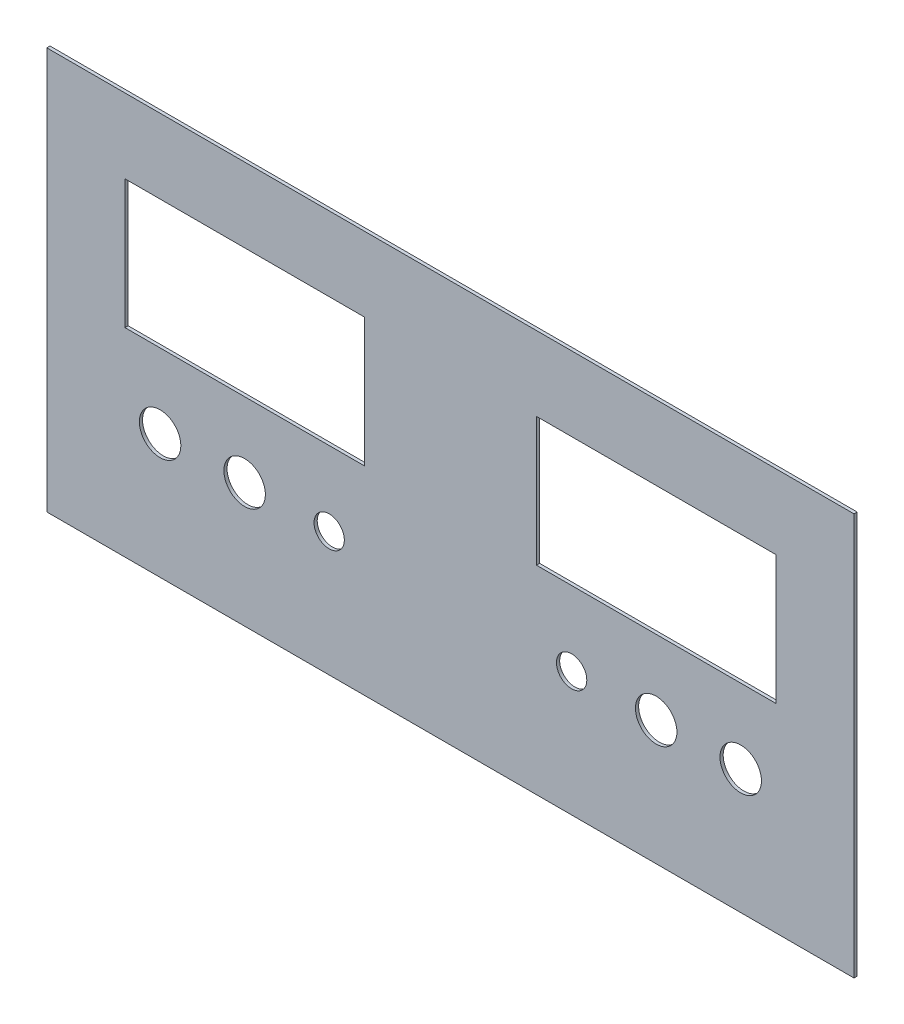
ISO-10303-21;
HEADER;
FILE_DESCRIPTION(('STEP AP214'),'2;1');
FILE_NAME('part.step','',(''),(''),'','','');
FILE_SCHEMA(('AUTOMOTIVE_DESIGN { 1 0 10303 214 1 1 1 1 }'));
ENDSEC;
DATA;
#1=APPLICATION_CONTEXT('core data for automotive mechanical design processes');
#2=APPLICATION_PROTOCOL_DEFINITION('international standard','automotive_design',2000,#1);
#3=PRODUCT_CONTEXT('',#1,'mechanical');
#4=PRODUCT('Part','Part','',(#3));
#5=PRODUCT_RELATED_PRODUCT_CATEGORY('part','',(#4));
#6=PRODUCT_DEFINITION_FORMATION('','',#4);
#7=PRODUCT_DEFINITION_CONTEXT('part definition',#1,'design');
#8=PRODUCT_DEFINITION('design','',#6,#7);
#9=PRODUCT_DEFINITION_SHAPE('','',#8);
#10=(LENGTH_UNIT() NAMED_UNIT(*) SI_UNIT(.MILLI.,.METRE.));
#11=(NAMED_UNIT(*) PLANE_ANGLE_UNIT() SI_UNIT($,.RADIAN.));
#12=(NAMED_UNIT(*) SI_UNIT($,.STERADIAN.) SOLID_ANGLE_UNIT());
#13=UNCERTAINTY_MEASURE_WITH_UNIT(LENGTH_MEASURE(1.E-05),#10,'distance_accuracy_value','');
#14=(GEOMETRIC_REPRESENTATION_CONTEXT(3) GLOBAL_UNCERTAINTY_ASSIGNED_CONTEXT((#13)) GLOBAL_UNIT_ASSIGNED_CONTEXT((#10,
#11,#12)) REPRESENTATION_CONTEXT('',''));
#15=CARTESIAN_POINT('',(0.,0.,0.));
#16=DIRECTION('',(0.,0.,1.));
#17=DIRECTION('',(1.,0.,0.));
#18=AXIS2_PLACEMENT_3D('',#15,#16,#17);
#19=CARTESIAN_POINT('',(126.5,63.,-1.));
#20=DIRECTION('',(1.,0.,0.));
#21=DIRECTION('',(0.,0.,-1.));
#22=AXIS2_PLACEMENT_3D('',#19,#20,#21);
#23=PLANE('',#22);
#24=DIRECTION('',(0.,1.,0.));
#25=VECTOR('',#24,1.);
#26=CARTESIAN_POINT('',(126.5,63.,0.));
#27=LINE('',#26,#25);
#28=CARTESIAN_POINT('',(126.5,-63.,0.));
#29=VERTEX_POINT('',#28);
#30=CARTESIAN_POINT('',(126.5,63.,0.));
#31=VERTEX_POINT('',#30);
#32=EDGE_CURVE('E213',#29,#31,#27,.T.);
#33=ORIENTED_EDGE('',*,*,#32,.F.);
#34=DIRECTION('',(0.,0.,1.));
#35=VECTOR('',#34,1.);
#36=CARTESIAN_POINT('',(126.5,-63.,-1.));
#37=LINE('',#36,#35);
#38=CARTESIAN_POINT('',(126.5,-63.,-1.));
#39=VERTEX_POINT('',#38);
#40=EDGE_CURVE('E224',#39,#29,#37,.T.);
#41=ORIENTED_EDGE('',*,*,#40,.F.);
#42=DIRECTION('',(0.,1.,0.));
#43=VECTOR('',#42,1.);
#44=CARTESIAN_POINT('',(126.5,63.,-1.));
#45=LINE('',#44,#43);
#46=CARTESIAN_POINT('',(126.5,63.,-1.));
#47=VERTEX_POINT('',#46);
#48=EDGE_CURVE('E199',#39,#47,#45,.T.);
#49=ORIENTED_EDGE('',*,*,#48,.T.);
#50=DIRECTION('',(0.,0.,1.));
#51=VECTOR('',#50,1.);
#52=CARTESIAN_POINT('',(126.5,63.,-1.));
#53=LINE('',#52,#51);
#54=EDGE_CURVE('E212',#47,#31,#53,.T.);
#55=ORIENTED_EDGE('',*,*,#54,.T.);
#56=EDGE_LOOP('',(#33,#41,#49,#55));
#57=FACE_BOUND('',#56,.T.);
#58=ADVANCED_FACE('F40',(#57),#23,.T.);
#59=CARTESIAN_POINT('',(-126.5,-63.,-1.));
#60=DIRECTION('',(0.,-1.,0.));
#61=DIRECTION('',(0.,0.,-1.));
#62=AXIS2_PLACEMENT_3D('',#59,#60,#61);
#63=PLANE('',#62);
#64=DIRECTION('',(1.,0.,0.));
#65=VECTOR('',#64,1.);
#66=CARTESIAN_POINT('',(-126.5,-63.,0.));
#67=LINE('',#66,#65);
#68=CARTESIAN_POINT('',(-126.5,-63.,0.));
#69=VERTEX_POINT('',#68);
#70=EDGE_CURVE('E203',#69,#29,#67,.T.);
#71=ORIENTED_EDGE('',*,*,#70,.F.);
#72=DIRECTION('',(0.,0.,1.));
#73=VECTOR('',#72,1.);
#74=CARTESIAN_POINT('',(-126.5,-63.,-1.));
#75=LINE('',#74,#73);
#76=CARTESIAN_POINT('',(-126.5,-63.,-1.));
#77=VERTEX_POINT('',#76);
#78=EDGE_CURVE('E227',#77,#69,#75,.T.);
#79=ORIENTED_EDGE('',*,*,#78,.F.);
#80=DIRECTION('',(1.,0.,0.));
#81=VECTOR('',#80,1.);
#82=CARTESIAN_POINT('',(-126.5,-63.,-1.));
#83=LINE('',#82,#81);
#84=EDGE_CURVE('E209',#77,#39,#83,.T.);
#85=ORIENTED_EDGE('',*,*,#84,.T.);
#86=ORIENTED_EDGE('',*,*,#40,.T.);
#87=EDGE_LOOP('',(#71,#79,#85,#86));
#88=FACE_BOUND('',#87,.T.);
#89=ADVANCED_FACE('F298',(#88),#63,.T.);
#90=CARTESIAN_POINT('',(-126.5,63.,-1.));
#91=DIRECTION('',(-1.,0.,0.));
#92=DIRECTION('',(0.,0.,1.));
#93=AXIS2_PLACEMENT_3D('',#90,#91,#92);
#94=PLANE('',#93);
#95=DIRECTION('',(0.,-1.,0.));
#96=VECTOR('',#95,1.);
#97=CARTESIAN_POINT('',(-126.5,63.,0.));
#98=LINE('',#97,#96);
#99=CARTESIAN_POINT('',(-126.5,63.,0.));
#100=VERTEX_POINT('',#99);
#101=EDGE_CURVE('E219',#100,#69,#98,.T.);
#102=ORIENTED_EDGE('',*,*,#101,.F.);
#103=DIRECTION('',(0.,0.,1.));
#104=VECTOR('',#103,1.);
#105=CARTESIAN_POINT('',(-126.5,63.,-1.));
#106=LINE('',#105,#104);
#107=CARTESIAN_POINT('',(-126.5,63.,-1.));
#108=VERTEX_POINT('',#107);
#109=EDGE_CURVE('E229',#108,#100,#106,.T.);
#110=ORIENTED_EDGE('',*,*,#109,.F.);
#111=DIRECTION('',(0.,-1.,0.));
#112=VECTOR('',#111,1.);
#113=CARTESIAN_POINT('',(-126.5,63.,-1.));
#114=LINE('',#113,#112);
#115=EDGE_CURVE('E206',#108,#77,#114,.T.);
#116=ORIENTED_EDGE('',*,*,#115,.T.);
#117=ORIENTED_EDGE('',*,*,#78,.T.);
#118=EDGE_LOOP('',(#102,#110,#116,#117));
#119=FACE_BOUND('',#118,.T.);
#120=ADVANCED_FACE('F296',(#119),#94,.T.);
#121=CARTESIAN_POINT('',(-126.5,63.,-1.));
#122=DIRECTION('',(0.,1.,0.));
#123=DIRECTION('',(0.,0.,1.));
#124=AXIS2_PLACEMENT_3D('',#121,#122,#123);
#125=PLANE('',#124);
#126=DIRECTION('',(-1.,0.,0.));
#127=VECTOR('',#126,1.);
#128=CARTESIAN_POINT('',(-126.5,63.,0.));
#129=LINE('',#128,#127);
#130=EDGE_CURVE('E216',#31,#100,#129,.T.);
#131=ORIENTED_EDGE('',*,*,#130,.F.);
#132=ORIENTED_EDGE('',*,*,#54,.F.);
#133=DIRECTION('',(-1.,0.,0.));
#134=VECTOR('',#133,1.);
#135=CARTESIAN_POINT('',(-126.5,63.,-1.));
#136=LINE('',#135,#134);
#137=EDGE_CURVE('E202',#47,#108,#136,.T.);
#138=ORIENTED_EDGE('',*,*,#137,.T.);
#139=ORIENTED_EDGE('',*,*,#109,.T.);
#140=EDGE_LOOP('',(#131,#132,#138,#139));
#141=FACE_BOUND('',#140,.T.);
#142=ADVANCED_FACE('F292',(#141),#125,.T.);
#143=CARTESIAN_POINT('',(0.,0.,-1.));
#144=DIRECTION('',(0.,0.,1.));
#145=DIRECTION('',(1.,0.,0.));
#146=AXIS2_PLACEMENT_3D('',#143,#144,#145);
#147=PLANE('',#146);
#148=CARTESIAN_POINT('',(38.,-24.,-1.));
#149=DIRECTION('',(0.,0.,-1.));
#150=DIRECTION('',(-1.,0.,0.));
#151=AXIS2_PLACEMENT_3D('',#148,#149,#150);
#152=CIRCLE('',#151,4.75);
#153=CARTESIAN_POINT('',(33.25,-24.,-1.));
#154=VERTEX_POINT('',#153);
#155=EDGE_CURVE('E165',#154,#154,#152,.T.);
#156=ORIENTED_EDGE('',*,*,#155,.F.);
#157=EDGE_LOOP('',(#156));
#158=FACE_BOUND('',#157,.T.);
#159=CARTESIAN_POINT('',(-91.,-24.,-1.));
#160=DIRECTION('',(0.,0.,-1.));
#161=DIRECTION('',(-1.,0.,0.));
#162=AXIS2_PLACEMENT_3D('',#159,#160,#161);
#163=CIRCLE('',#162,6.5);
#164=CARTESIAN_POINT('',(-97.5,-24.,-1.));
#165=VERTEX_POINT('',#164);
#166=EDGE_CURVE('E184',#165,#165,#163,.T.);
#167=ORIENTED_EDGE('',*,*,#166,.F.);
#168=EDGE_LOOP('',(#167));
#169=FACE_BOUND('',#168,.T.);
#170=CARTESIAN_POINT('',(-64.5,-24.,-1.));
#171=DIRECTION('',(0.,0.,-1.));
#172=DIRECTION('',(-1.,0.,0.));
#173=AXIS2_PLACEMENT_3D('',#170,#171,#172);
#174=CIRCLE('',#173,6.5);
#175=CARTESIAN_POINT('',(-71.,-24.,-1.));
#176=VERTEX_POINT('',#175);
#177=EDGE_CURVE('E187',#176,#176,#174,.T.);
#178=ORIENTED_EDGE('',*,*,#177,.F.);
#179=EDGE_LOOP('',(#178));
#180=FACE_BOUND('',#179,.T.);
#181=CARTESIAN_POINT('',(64.5,-24.,-1.));
#182=DIRECTION('',(0.,0.,-1.));
#183=DIRECTION('',(-1.,0.,0.));
#184=AXIS2_PLACEMENT_3D('',#181,#182,#183);
#185=CIRCLE('',#184,6.5);
#186=CARTESIAN_POINT('',(58.,-24.,-1.));
#187=VERTEX_POINT('',#186);
#188=EDGE_CURVE('E190',#187,#187,#185,.T.);
#189=ORIENTED_EDGE('',*,*,#188,.F.);
#190=EDGE_LOOP('',(#189));
#191=FACE_BOUND('',#190,.T.);
#192=DIRECTION('',(-1.,0.,0.));
#193=VECTOR('',#192,1.);
#194=CARTESIAN_POINT('',(-27.0000000002075,-0.700000000000002,-1.));
#195=LINE('',#194,#193);
#196=CARTESIAN_POINT('',(-27.0000000002075,-0.700000000000002,-1.));
#197=VERTEX_POINT('',#196);
#198=CARTESIAN_POINT('',(-102.000000000207,-0.700000000000002,-1.));
#199=VERTEX_POINT('',#198);
#200=EDGE_CURVE('E146',#197,#199,#195,.T.);
#201=ORIENTED_EDGE('',*,*,#200,.F.);
#202=DIRECTION('',(0.,-1.,0.));
#203=VECTOR('',#202,1.);
#204=CARTESIAN_POINT('',(-27.0000000002075,39.7000000004771,-1.));
#205=LINE('',#204,#203);
#206=CARTESIAN_POINT('',(-27.0000000002075,39.7000000004771,-1.));
#207=VERTEX_POINT('',#206);
#208=EDGE_CURVE('E56',#207,#197,#205,.T.);
#209=ORIENTED_EDGE('',*,*,#208,.F.);
#210=DIRECTION('',(1.,0.,0.));
#211=VECTOR('',#210,1.);
#212=CARTESIAN_POINT('',(-27.0000000002075,39.7000000004771,-1.));
#213=LINE('',#212,#211);
#214=CARTESIAN_POINT('',(-102.000000000207,39.7000000004771,-1.));
#215=VERTEX_POINT('',#214);
#216=EDGE_CURVE('E153',#215,#207,#213,.T.);
#217=ORIENTED_EDGE('',*,*,#216,.F.);
#218=DIRECTION('',(0.,1.,0.));
#219=VECTOR('',#218,1.);
#220=CARTESIAN_POINT('',(-102.000000000207,39.7000000004771,-1.));
#221=LINE('',#220,#219);
#222=EDGE_CURVE('E136',#199,#215,#221,.T.);
#223=ORIENTED_EDGE('',*,*,#222,.F.);
#224=EDGE_LOOP('',(#201,#209,#217,#223));
#225=FACE_BOUND('',#224,.T.);
#226=DIRECTION('',(-1.,0.,0.));
#227=VECTOR('',#226,1.);
#228=CARTESIAN_POINT('',(101.999999999792,-0.700000000000002,-1.));
#229=LINE('',#228,#227);
#230=CARTESIAN_POINT('',(101.999999999792,-0.700000000000002,-1.));
#231=VERTEX_POINT('',#230);
#232=CARTESIAN_POINT('',(26.9999999997924,-0.700000000000002,-1.));
#233=VERTEX_POINT('',#232);
#234=EDGE_CURVE('E168',#231,#233,#229,.T.);
#235=ORIENTED_EDGE('',*,*,#234,.F.);
#236=DIRECTION('',(0.,-1.,0.));
#237=VECTOR('',#236,1.);
#238=CARTESIAN_POINT('',(101.999999999792,39.7000000006584,-1.));
#239=LINE('',#238,#237);
#240=CARTESIAN_POINT('',(101.999999999792,39.7000000006584,-1.));
#241=VERTEX_POINT('',#240);
#242=EDGE_CURVE('E64',#241,#231,#239,.T.);
#243=ORIENTED_EDGE('',*,*,#242,.F.);
#244=DIRECTION('',(1.,0.,0.));
#245=VECTOR('',#244,1.);
#246=CARTESIAN_POINT('',(101.999999999792,39.7000000006584,-1.));
#247=LINE('',#246,#245);
#248=CARTESIAN_POINT('',(26.9999999997924,39.7000000006584,-1.));
#249=VERTEX_POINT('',#248);
#250=EDGE_CURVE('E174',#249,#241,#247,.T.);
#251=ORIENTED_EDGE('',*,*,#250,.F.);
#252=DIRECTION('',(0.,1.,0.));
#253=VECTOR('',#252,1.);
#254=CARTESIAN_POINT('',(26.9999999997924,39.7000000006584,-1.));
#255=LINE('',#254,#253);
#256=EDGE_CURVE('E171',#233,#249,#255,.T.);
#257=ORIENTED_EDGE('',*,*,#256,.F.);
#258=EDGE_LOOP('',(#235,#243,#251,#257));
#259=FACE_BOUND('',#258,.T.);
#260=CARTESIAN_POINT('',(-38.,-24.,-1.));
#261=DIRECTION('',(0.,0.,-1.));
#262=DIRECTION('',(-1.,0.,0.));
#263=AXIS2_PLACEMENT_3D('',#260,#261,#262);
#264=CIRCLE('',#263,4.75);
#265=CARTESIAN_POINT('',(-42.75,-24.,-1.));
#266=VERTEX_POINT('',#265);
#267=EDGE_CURVE('E162',#266,#266,#264,.T.);
#268=ORIENTED_EDGE('',*,*,#267,.F.);
#269=EDGE_LOOP('',(#268));
#270=FACE_BOUND('',#269,.T.);
#271=CARTESIAN_POINT('',(91.,-24.,-1.));
#272=DIRECTION('',(0.,0.,-1.));
#273=DIRECTION('',(-1.,0.,0.));
#274=AXIS2_PLACEMENT_3D('',#271,#272,#273);
#275=CIRCLE('',#274,6.5);
#276=CARTESIAN_POINT('',(84.5,-24.,-1.));
#277=VERTEX_POINT('',#276);
#278=EDGE_CURVE('E193',#277,#277,#275,.T.);
#279=ORIENTED_EDGE('',*,*,#278,.F.);
#280=EDGE_LOOP('',(#279));
#281=FACE_BOUND('',#280,.T.);
#282=ORIENTED_EDGE('',*,*,#48,.F.);
#283=ORIENTED_EDGE('',*,*,#84,.F.);
#284=ORIENTED_EDGE('',*,*,#115,.F.);
#285=ORIENTED_EDGE('',*,*,#137,.F.);
#286=EDGE_LOOP('',(#282,#283,#284,#285));
#287=FACE_BOUND('',#286,.T.);
#288=ADVANCED_FACE('F150',(#158,#169,#180,#191,#225,#259,#270,#281,#287),#147,.F.);
#289=CARTESIAN_POINT('',(0.,0.,0.));
#290=DIRECTION('',(0.,0.,1.));
#291=DIRECTION('',(1.,0.,0.));
#292=AXIS2_PLACEMENT_3D('',#289,#290,#291);
#293=PLANE('',#292);
#294=CARTESIAN_POINT('',(38.,-24.,0.));
#295=DIRECTION('',(0.,0.,1.));
#296=DIRECTION('',(1.,0.,0.));
#297=AXIS2_PLACEMENT_3D('',#294,#295,#296);
#298=CIRCLE('',#297,4.75);
#299=CARTESIAN_POINT('',(42.75,-24.,0.));
#300=VERTEX_POINT('',#299);
#301=EDGE_CURVE('E43',#300,#300,#298,.T.);
#302=ORIENTED_EDGE('',*,*,#301,.F.);
#303=EDGE_LOOP('',(#302));
#304=FACE_BOUND('',#303,.T.);
#305=CARTESIAN_POINT('',(-91.,-24.,0.));
#306=DIRECTION('',(0.,0.,1.));
#307=DIRECTION('',(1.,0.,0.));
#308=AXIS2_PLACEMENT_3D('',#305,#306,#307);
#309=CIRCLE('',#308,6.5);
#310=CARTESIAN_POINT('',(-84.5,-24.,0.));
#311=VERTEX_POINT('',#310);
#312=EDGE_CURVE('E254',#311,#311,#309,.T.);
#313=ORIENTED_EDGE('',*,*,#312,.F.);
#314=EDGE_LOOP('',(#313));
#315=FACE_BOUND('',#314,.T.);
#316=CARTESIAN_POINT('',(-64.5,-24.,0.));
#317=DIRECTION('',(0.,0.,1.));
#318=DIRECTION('',(1.,0.,0.));
#319=AXIS2_PLACEMENT_3D('',#316,#317,#318);
#320=CIRCLE('',#319,6.5);
#321=CARTESIAN_POINT('',(-58.,-24.,0.));
#322=VERTEX_POINT('',#321);
#323=EDGE_CURVE('E252',#322,#322,#320,.T.);
#324=ORIENTED_EDGE('',*,*,#323,.F.);
#325=EDGE_LOOP('',(#324));
#326=FACE_BOUND('',#325,.T.);
#327=CARTESIAN_POINT('',(64.5,-24.,0.));
#328=DIRECTION('',(0.,0.,1.));
#329=DIRECTION('',(1.,0.,0.));
#330=AXIS2_PLACEMENT_3D('',#327,#328,#329);
#331=CIRCLE('',#330,6.5);
#332=CARTESIAN_POINT('',(71.,-24.,0.));
#333=VERTEX_POINT('',#332);
#334=EDGE_CURVE('E237',#333,#333,#331,.T.);
#335=ORIENTED_EDGE('',*,*,#334,.F.);
#336=EDGE_LOOP('',(#335));
#337=FACE_BOUND('',#336,.T.);
#338=DIRECTION('',(0.,1.,0.));
#339=VECTOR('',#338,1.);
#340=CARTESIAN_POINT('',(-27.0000000002075,0.,0.));
#341=LINE('',#340,#339);
#342=CARTESIAN_POINT('',(-27.0000000002075,-0.700000000000002,0.));
#343=VERTEX_POINT('',#342);
#344=CARTESIAN_POINT('',(-27.0000000002075,39.7000000004771,0.));
#345=VERTEX_POINT('',#344);
#346=EDGE_CURVE('E11',#343,#345,#341,.T.);
#347=ORIENTED_EDGE('',*,*,#346,.F.);
#348=DIRECTION('',(1.,0.,0.));
#349=VECTOR('',#348,1.);
#350=CARTESIAN_POINT('',(0.,-0.700000000000002,0.));
#351=LINE('',#350,#349);
#352=CARTESIAN_POINT('',(-102.000000000207,-0.700000000000002,0.));
#353=VERTEX_POINT('',#352);
#354=EDGE_CURVE('E246',#353,#343,#351,.T.);
#355=ORIENTED_EDGE('',*,*,#354,.F.);
#356=DIRECTION('',(0.,-1.,0.));
#357=VECTOR('',#356,1.);
#358=CARTESIAN_POINT('',(-102.000000000207,0.,0.));
#359=LINE('',#358,#357);
#360=CARTESIAN_POINT('',(-102.000000000207,39.7000000004771,0.));
#361=VERTEX_POINT('',#360);
#362=EDGE_CURVE('E139',#361,#353,#359,.T.);
#363=ORIENTED_EDGE('',*,*,#362,.F.);
#364=DIRECTION('',(-1.,0.,0.));
#365=VECTOR('',#364,1.);
#366=CARTESIAN_POINT('',(0.,39.7000000004771,0.));
#367=LINE('',#366,#365);
#368=EDGE_CURVE('E48',#345,#361,#367,.T.);
#369=ORIENTED_EDGE('',*,*,#368,.F.);
#370=EDGE_LOOP('',(#347,#355,#363,#369));
#371=FACE_BOUND('',#370,.T.);
#372=DIRECTION('',(0.,1.,0.));
#373=VECTOR('',#372,1.);
#374=CARTESIAN_POINT('',(101.999999999792,0.,0.));
#375=LINE('',#374,#373);
#376=CARTESIAN_POINT('',(101.999999999792,-0.700000000000002,0.));
#377=VERTEX_POINT('',#376);
#378=CARTESIAN_POINT('',(101.999999999792,39.7000000006584,0.));
#379=VERTEX_POINT('',#378);
#380=EDGE_CURVE('E244',#377,#379,#375,.T.);
#381=ORIENTED_EDGE('',*,*,#380,.F.);
#382=DIRECTION('',(1.,0.,0.));
#383=VECTOR('',#382,1.);
#384=CARTESIAN_POINT('',(0.,-0.700000000000002,0.));
#385=LINE('',#384,#383);
#386=CARTESIAN_POINT('',(26.9999999997924,-0.700000000000002,0.));
#387=VERTEX_POINT('',#386);
#388=EDGE_CURVE('E226',#387,#377,#385,.T.);
#389=ORIENTED_EDGE('',*,*,#388,.F.);
#390=DIRECTION('',(0.,-1.,0.));
#391=VECTOR('',#390,1.);
#392=CARTESIAN_POINT('',(26.9999999997924,0.,0.));
#393=LINE('',#392,#391);
#394=CARTESIAN_POINT('',(26.9999999997924,39.7000000006584,0.));
#395=VERTEX_POINT('',#394);
#396=EDGE_CURVE('E239',#395,#387,#393,.T.);
#397=ORIENTED_EDGE('',*,*,#396,.F.);
#398=DIRECTION('',(-1.,0.,0.));
#399=VECTOR('',#398,1.);
#400=CARTESIAN_POINT('',(0.,39.7000000006584,0.));
#401=LINE('',#400,#399);
#402=EDGE_CURVE('E242',#379,#395,#401,.T.);
#403=ORIENTED_EDGE('',*,*,#402,.F.);
#404=EDGE_LOOP('',(#381,#389,#397,#403));
#405=FACE_BOUND('',#404,.T.);
#406=CARTESIAN_POINT('',(-38.,-24.,0.));
#407=DIRECTION('',(0.,0.,1.));
#408=DIRECTION('',(1.,0.,0.));
#409=AXIS2_PLACEMENT_3D('',#406,#407,#408);
#410=CIRCLE('',#409,4.75);
#411=CARTESIAN_POINT('',(-33.25,-24.,0.));
#412=VERTEX_POINT('',#411);
#413=EDGE_CURVE('E234',#412,#412,#410,.T.);
#414=ORIENTED_EDGE('',*,*,#413,.F.);
#415=EDGE_LOOP('',(#414));
#416=FACE_BOUND('',#415,.T.);
#417=CARTESIAN_POINT('',(91.,-24.,0.));
#418=DIRECTION('',(0.,0.,1.));
#419=DIRECTION('',(1.,0.,0.));
#420=AXIS2_PLACEMENT_3D('',#417,#418,#419);
#421=CIRCLE('',#420,6.5);
#422=CARTESIAN_POINT('',(97.5,-24.,0.));
#423=VERTEX_POINT('',#422);
#424=EDGE_CURVE('E198',#423,#423,#421,.T.);
#425=ORIENTED_EDGE('',*,*,#424,.F.);
#426=EDGE_LOOP('',(#425));
#427=FACE_BOUND('',#426,.T.);
#428=ORIENTED_EDGE('',*,*,#32,.T.);
#429=ORIENTED_EDGE('',*,*,#130,.T.);
#430=ORIENTED_EDGE('',*,*,#101,.T.);
#431=ORIENTED_EDGE('',*,*,#70,.T.);
#432=EDGE_LOOP('',(#428,#429,#430,#431));
#433=FACE_BOUND('',#432,.T.);
#434=ADVANCED_FACE('F264',(#304,#315,#326,#337,#371,#405,#416,#427,#433),#293,.T.);
#435=CARTESIAN_POINT('',(91.,-24.,9.));
#436=DIRECTION('',(0.,0.,-1.));
#437=DIRECTION('',(-1.,0.,0.));
#438=AXIS2_PLACEMENT_3D('',#435,#436,#437);
#439=CYLINDRICAL_SURFACE('',#438,6.5);
#440=ORIENTED_EDGE('',*,*,#424,.T.);
#441=EDGE_LOOP('',(#440));
#442=FACE_BOUND('',#441,.T.);
#443=ORIENTED_EDGE('',*,*,#278,.T.);
#444=EDGE_LOOP('',(#443));
#445=FACE_BOUND('',#444,.T.);
#446=ADVANCED_FACE('F267',(#442,#445),#439,.F.);
#447=CARTESIAN_POINT('',(-38.,-24.,9.));
#448=DIRECTION('',(0.,0.,-1.));
#449=DIRECTION('',(-1.,0.,0.));
#450=AXIS2_PLACEMENT_3D('',#447,#448,#449);
#451=CYLINDRICAL_SURFACE('',#450,4.75);
#452=ORIENTED_EDGE('',*,*,#413,.T.);
#453=EDGE_LOOP('',(#452));
#454=FACE_BOUND('',#453,.T.);
#455=ORIENTED_EDGE('',*,*,#267,.T.);
#456=EDGE_LOOP('',(#455));
#457=FACE_BOUND('',#456,.T.);
#458=ADVANCED_FACE('F347',(#454,#457),#451,.F.);
#459=CARTESIAN_POINT('',(101.999999999792,39.7000000006584,9.));
#460=DIRECTION('',(1.,0.,0.));
#461=DIRECTION('',(0.,0.,-1.));
#462=AXIS2_PLACEMENT_3D('',#459,#460,#461);
#463=PLANE('',#462);
#464=ORIENTED_EDGE('',*,*,#380,.T.);
#465=DIRECTION('',(0.,0.,-1.));
#466=VECTOR('',#465,1.);
#467=CARTESIAN_POINT('',(101.999999999792,39.7000000006584,9.));
#468=LINE('',#467,#466);
#469=EDGE_CURVE('E166',#379,#241,#468,.T.);
#470=ORIENTED_EDGE('',*,*,#469,.T.);
#471=ORIENTED_EDGE('',*,*,#242,.T.);
#472=DIRECTION('',(0.,0.,-1.));
#473=VECTOR('',#472,1.);
#474=CARTESIAN_POINT('',(101.999999999792,-0.700000000000002,9.));
#475=LINE('',#474,#473);
#476=EDGE_CURVE('E177',#377,#231,#475,.T.);
#477=ORIENTED_EDGE('',*,*,#476,.F.);
#478=EDGE_LOOP('',(#464,#470,#471,#477));
#479=FACE_BOUND('',#478,.T.);
#480=ADVANCED_FACE('F357',(#479),#463,.F.);
#481=CARTESIAN_POINT('',(101.999999999792,39.7000000006584,9.));
#482=DIRECTION('',(0.,1.,0.));
#483=DIRECTION('',(0.,0.,1.));
#484=AXIS2_PLACEMENT_3D('',#481,#482,#483);
#485=PLANE('',#484);
#486=ORIENTED_EDGE('',*,*,#402,.T.);
#487=DIRECTION('',(0.,0.,-1.));
#488=VECTOR('',#487,1.);
#489=CARTESIAN_POINT('',(26.9999999997924,39.7000000006584,9.));
#490=LINE('',#489,#488);
#491=EDGE_CURVE('E179',#395,#249,#490,.T.);
#492=ORIENTED_EDGE('',*,*,#491,.T.);
#493=ORIENTED_EDGE('',*,*,#250,.T.);
#494=ORIENTED_EDGE('',*,*,#469,.F.);
#495=EDGE_LOOP('',(#486,#492,#493,#494));
#496=FACE_BOUND('',#495,.T.);
#497=ADVANCED_FACE('F368',(#496),#485,.F.);
#498=CARTESIAN_POINT('',(26.9999999997924,39.7000000006584,9.));
#499=DIRECTION('',(-1.,0.,0.));
#500=DIRECTION('',(0.,0.,1.));
#501=AXIS2_PLACEMENT_3D('',#498,#499,#500);
#502=PLANE('',#501);
#503=ORIENTED_EDGE('',*,*,#396,.T.);
#504=DIRECTION('',(0.,0.,-1.));
#505=VECTOR('',#504,1.);
#506=CARTESIAN_POINT('',(26.9999999997924,-0.700000000000002,9.));
#507=LINE('',#506,#505);
#508=EDGE_CURVE('E181',#387,#233,#507,.T.);
#509=ORIENTED_EDGE('',*,*,#508,.T.);
#510=ORIENTED_EDGE('',*,*,#256,.T.);
#511=ORIENTED_EDGE('',*,*,#491,.F.);
#512=EDGE_LOOP('',(#503,#509,#510,#511));
#513=FACE_BOUND('',#512,.T.);
#514=ADVANCED_FACE('F378',(#513),#502,.F.);
#515=CARTESIAN_POINT('',(101.999999999792,-0.700000000000002,9.));
#516=DIRECTION('',(0.,-1.,0.));
#517=DIRECTION('',(0.,0.,-1.));
#518=AXIS2_PLACEMENT_3D('',#515,#516,#517);
#519=PLANE('',#518);
#520=ORIENTED_EDGE('',*,*,#388,.T.);
#521=ORIENTED_EDGE('',*,*,#476,.T.);
#522=ORIENTED_EDGE('',*,*,#234,.T.);
#523=ORIENTED_EDGE('',*,*,#508,.F.);
#524=EDGE_LOOP('',(#520,#521,#522,#523));
#525=FACE_BOUND('',#524,.T.);
#526=ADVANCED_FACE('F389',(#525),#519,.F.);
#527=CARTESIAN_POINT('',(-27.0000000002075,39.7000000004771,9.));
#528=DIRECTION('',(1.,0.,0.));
#529=DIRECTION('',(0.,0.,-1.));
#530=AXIS2_PLACEMENT_3D('',#527,#528,#529);
#531=PLANE('',#530);
#532=ORIENTED_EDGE('',*,*,#346,.T.);
#533=DIRECTION('',(0.,0.,-1.));
#534=VECTOR('',#533,1.);
#535=CARTESIAN_POINT('',(-27.0000000002075,39.7000000004771,9.));
#536=LINE('',#535,#534);
#537=EDGE_CURVE('E158',#345,#207,#536,.T.);
#538=ORIENTED_EDGE('',*,*,#537,.T.);
#539=ORIENTED_EDGE('',*,*,#208,.T.);
#540=DIRECTION('',(0.,0.,-1.));
#541=VECTOR('',#540,1.);
#542=CARTESIAN_POINT('',(-27.0000000002075,-0.700000000000002,9.));
#543=LINE('',#542,#541);
#544=EDGE_CURVE('E143',#343,#197,#543,.T.);
#545=ORIENTED_EDGE('',*,*,#544,.F.);
#546=EDGE_LOOP('',(#532,#538,#539,#545));
#547=FACE_BOUND('',#546,.T.);
#548=ADVANCED_FACE('F400',(#547),#531,.F.);
#549=CARTESIAN_POINT('',(-27.0000000002075,39.7000000004771,9.));
#550=DIRECTION('',(0.,1.,0.));
#551=DIRECTION('',(0.,0.,1.));
#552=AXIS2_PLACEMENT_3D('',#549,#550,#551);
#553=PLANE('',#552);
#554=ORIENTED_EDGE('',*,*,#368,.T.);
#555=DIRECTION('',(0.,0.,-1.));
#556=VECTOR('',#555,1.);
#557=CARTESIAN_POINT('',(-102.000000000207,39.7000000004771,9.));
#558=LINE('',#557,#556);
#559=EDGE_CURVE('E142',#361,#215,#558,.T.);
#560=ORIENTED_EDGE('',*,*,#559,.T.);
#561=ORIENTED_EDGE('',*,*,#216,.T.);
#562=ORIENTED_EDGE('',*,*,#537,.F.);
#563=EDGE_LOOP('',(#554,#560,#561,#562));
#564=FACE_BOUND('',#563,.T.);
#565=ADVANCED_FACE('F411',(#564),#553,.F.);
#566=CARTESIAN_POINT('',(-102.000000000207,39.7000000004771,9.));
#567=DIRECTION('',(-1.,0.,0.));
#568=DIRECTION('',(0.,0.,1.));
#569=AXIS2_PLACEMENT_3D('',#566,#567,#568);
#570=PLANE('',#569);
#571=ORIENTED_EDGE('',*,*,#362,.T.);
#572=DIRECTION('',(0.,0.,-1.));
#573=VECTOR('',#572,1.);
#574=CARTESIAN_POINT('',(-102.000000000207,-0.700000000000002,9.));
#575=LINE('',#574,#573);
#576=EDGE_CURVE('E131',#353,#199,#575,.T.);
#577=ORIENTED_EDGE('',*,*,#576,.T.);
#578=ORIENTED_EDGE('',*,*,#222,.T.);
#579=ORIENTED_EDGE('',*,*,#559,.F.);
#580=EDGE_LOOP('',(#571,#577,#578,#579));
#581=FACE_BOUND('',#580,.T.);
#582=ADVANCED_FACE('F133',(#581),#570,.F.);
#583=CARTESIAN_POINT('',(-27.0000000002075,-0.700000000000002,9.));
#584=DIRECTION('',(0.,-1.,0.));
#585=DIRECTION('',(0.,0.,-1.));
#586=AXIS2_PLACEMENT_3D('',#583,#584,#585);
#587=PLANE('',#586);
#588=ORIENTED_EDGE('',*,*,#354,.T.);
#589=ORIENTED_EDGE('',*,*,#544,.T.);
#590=ORIENTED_EDGE('',*,*,#200,.T.);
#591=ORIENTED_EDGE('',*,*,#576,.F.);
#592=EDGE_LOOP('',(#588,#589,#590,#591));
#593=FACE_BOUND('',#592,.T.);
#594=ADVANCED_FACE('F147',(#593),#587,.F.);
#595=CARTESIAN_POINT('',(64.5,-24.,9.));
#596=DIRECTION('',(0.,0.,-1.));
#597=DIRECTION('',(-1.,0.,0.));
#598=AXIS2_PLACEMENT_3D('',#595,#596,#597);
#599=CYLINDRICAL_SURFACE('',#598,6.5);
#600=ORIENTED_EDGE('',*,*,#334,.T.);
#601=EDGE_LOOP('',(#600));
#602=FACE_BOUND('',#601,.T.);
#603=ORIENTED_EDGE('',*,*,#188,.T.);
#604=EDGE_LOOP('',(#603));
#605=FACE_BOUND('',#604,.T.);
#606=ADVANCED_FACE('F440',(#602,#605),#599,.F.);
#607=CARTESIAN_POINT('',(-64.5,-24.,9.));
#608=DIRECTION('',(0.,0.,-1.));
#609=DIRECTION('',(-1.,0.,0.));
#610=AXIS2_PLACEMENT_3D('',#607,#608,#609);
#611=CYLINDRICAL_SURFACE('',#610,6.5);
#612=ORIENTED_EDGE('',*,*,#323,.T.);
#613=EDGE_LOOP('',(#612));
#614=FACE_BOUND('',#613,.T.);
#615=ORIENTED_EDGE('',*,*,#177,.T.);
#616=EDGE_LOOP('',(#615));
#617=FACE_BOUND('',#616,.T.);
#618=ADVANCED_FACE('F450',(#614,#617),#611,.F.);
#619=CARTESIAN_POINT('',(-91.,-24.,9.));
#620=DIRECTION('',(0.,0.,-1.));
#621=DIRECTION('',(-1.,0.,0.));
#622=AXIS2_PLACEMENT_3D('',#619,#620,#621);
#623=CYLINDRICAL_SURFACE('',#622,6.5);
#624=ORIENTED_EDGE('',*,*,#312,.T.);
#625=EDGE_LOOP('',(#624));
#626=FACE_BOUND('',#625,.T.);
#627=ORIENTED_EDGE('',*,*,#166,.T.);
#628=EDGE_LOOP('',(#627));
#629=FACE_BOUND('',#628,.T.);
#630=ADVANCED_FACE('F461',(#626,#629),#623,.F.);
#631=CARTESIAN_POINT('',(38.,-24.,9.));
#632=DIRECTION('',(0.,0.,-1.));
#633=DIRECTION('',(-1.,0.,0.));
#634=AXIS2_PLACEMENT_3D('',#631,#632,#633);
#635=CYLINDRICAL_SURFACE('',#634,4.75);
#636=ORIENTED_EDGE('',*,*,#301,.T.);
#637=EDGE_LOOP('',(#636));
#638=FACE_BOUND('',#637,.T.);
#639=ORIENTED_EDGE('',*,*,#155,.T.);
#640=EDGE_LOOP('',(#639));
#641=FACE_BOUND('',#640,.T.);
#642=ADVANCED_FACE('F261',(#638,#641),#635,.F.);
#643=CLOSED_SHELL('',(#58,#89,#120,#142,#288,#434,#446,#458,#480,#497,#514,#526,#548,#565,#582,
#594,#606,#618,#630,#642));
#644=MANIFOLD_SOLID_BREP('B2',#643);
#645=ADVANCED_BREP_SHAPE_REPRESENTATION('',(#18,#644),#14);
#646=SHAPE_DEFINITION_REPRESENTATION(#9,#645);
ENDSEC;
END-ISO-10303-21;
